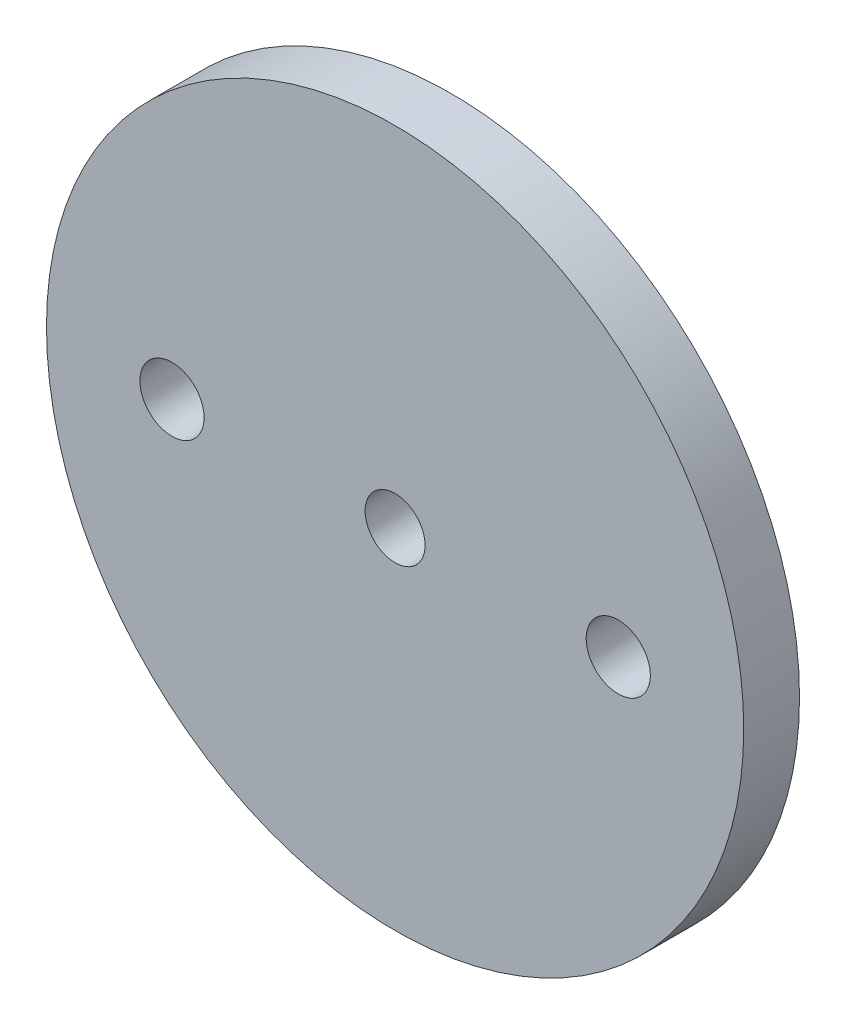
ISO-10303-21;
HEADER;
FILE_DESCRIPTION(('STEP AP214'),'2;1');
FILE_NAME('part.step','',(''),(''),'','','');
FILE_SCHEMA(('AUTOMOTIVE_DESIGN { 1 0 10303 214 1 1 1 1 }'));
ENDSEC;
DATA;
#1=APPLICATION_CONTEXT('core data for automotive mechanical design processes');
#2=APPLICATION_PROTOCOL_DEFINITION('international standard','automotive_design',2000,#1);
#3=PRODUCT_CONTEXT('',#1,'mechanical');
#4=PRODUCT('Part','Part','',(#3));
#5=PRODUCT_RELATED_PRODUCT_CATEGORY('part','',(#4));
#6=PRODUCT_DEFINITION_FORMATION('','',#4);
#7=PRODUCT_DEFINITION_CONTEXT('part definition',#1,'design');
#8=PRODUCT_DEFINITION('design','',#6,#7);
#9=PRODUCT_DEFINITION_SHAPE('','',#8);
#10=(LENGTH_UNIT() NAMED_UNIT(*) SI_UNIT(.MILLI.,.METRE.));
#11=(NAMED_UNIT(*) PLANE_ANGLE_UNIT() SI_UNIT($,.RADIAN.));
#12=(NAMED_UNIT(*) SI_UNIT($,.STERADIAN.) SOLID_ANGLE_UNIT());
#13=UNCERTAINTY_MEASURE_WITH_UNIT(LENGTH_MEASURE(1.E-05),#10,'distance_accuracy_value','');
#14=(GEOMETRIC_REPRESENTATION_CONTEXT(3) GLOBAL_UNCERTAINTY_ASSIGNED_CONTEXT((#13)) GLOBAL_UNIT_ASSIGNED_CONTEXT((#10,
#11,#12)) REPRESENTATION_CONTEXT('',''));
#15=CARTESIAN_POINT('',(0.,0.,0.));
#16=DIRECTION('',(0.,0.,1.));
#17=DIRECTION('',(1.,0.,0.));
#18=AXIS2_PLACEMENT_3D('',#15,#16,#17);
#19=CARTESIAN_POINT('',(0.,0.,2.));
#20=DIRECTION('',(0.,0.,1.));
#21=DIRECTION('',(1.,0.,0.));
#22=AXIS2_PLACEMENT_3D('',#19,#20,#21);
#23=PLANE('',#22);
#24=CARTESIAN_POINT('',(-8.,0.,2.));
#25=DIRECTION('',(0.,0.,1.));
#26=DIRECTION('',(1.,0.,0.));
#27=AXIS2_PLACEMENT_3D('',#24,#25,#26);
#28=CIRCLE('',#27,1.15);
#29=CARTESIAN_POINT('',(-6.85,0.,2.));
#30=VERTEX_POINT('',#29);
#31=EDGE_CURVE('E51',#30,#30,#28,.T.);
#32=ORIENTED_EDGE('',*,*,#31,.F.);
#33=EDGE_LOOP('',(#32));
#34=FACE_BOUND('',#33,.T.);
#35=CARTESIAN_POINT('',(0.,0.,2.));
#36=DIRECTION('',(0.,0.,1.));
#37=DIRECTION('',(1.,0.,0.));
#38=AXIS2_PLACEMENT_3D('',#35,#36,#37);
#39=CIRCLE('',#38,12.5);
#40=CARTESIAN_POINT('',(12.5,0.,2.));
#41=VERTEX_POINT('',#40);
#42=EDGE_CURVE('E10',#41,#41,#39,.T.);
#43=ORIENTED_EDGE('',*,*,#42,.T.);
#44=EDGE_LOOP('',(#43));
#45=FACE_BOUND('',#44,.T.);
#46=CARTESIAN_POINT('',(0.,0.,2.));
#47=DIRECTION('',(0.,0.,1.));
#48=DIRECTION('',(1.,0.,0.));
#49=AXIS2_PLACEMENT_3D('',#46,#47,#48);
#50=CIRCLE('',#49,1.075);
#51=CARTESIAN_POINT('',(1.075,0.,2.));
#52=VERTEX_POINT('',#51);
#53=EDGE_CURVE('E46',#52,#52,#50,.T.);
#54=ORIENTED_EDGE('',*,*,#53,.F.);
#55=EDGE_LOOP('',(#54));
#56=FACE_BOUND('',#55,.T.);
#57=CARTESIAN_POINT('',(8.00000000000025,0.,2.));
#58=DIRECTION('',(0.,0.,1.));
#59=DIRECTION('',(-1.,0.,0.));
#60=AXIS2_PLACEMENT_3D('',#57,#58,#59);
#61=CIRCLE('',#60,1.15);
#62=CARTESIAN_POINT('',(6.85000000000025,0.,2.));
#63=VERTEX_POINT('',#62);
#64=EDGE_CURVE('E57',#63,#63,#61,.T.);
#65=ORIENTED_EDGE('',*,*,#64,.F.);
#66=EDGE_LOOP('',(#65));
#67=FACE_BOUND('',#66,.T.);
#68=ADVANCED_FACE('F35',(#34,#45,#56,#67),#23,.T.);
#69=CARTESIAN_POINT('',(0.,0.,0.));
#70=DIRECTION('',(0.,0.,1.));
#71=DIRECTION('',(1.,0.,0.));
#72=AXIS2_PLACEMENT_3D('',#69,#70,#71);
#73=PLANE('',#72);
#74=CARTESIAN_POINT('',(0.,0.,0.));
#75=DIRECTION('',(0.,0.,1.));
#76=DIRECTION('',(1.,0.,0.));
#77=AXIS2_PLACEMENT_3D('',#74,#75,#76);
#78=CIRCLE('',#77,12.5);
#79=CARTESIAN_POINT('',(12.5,0.,0.));
#80=VERTEX_POINT('',#79);
#81=EDGE_CURVE('E39',#80,#80,#78,.T.);
#82=ORIENTED_EDGE('',*,*,#81,.F.);
#83=EDGE_LOOP('',(#82));
#84=FACE_BOUND('',#83,.T.);
#85=CARTESIAN_POINT('',(0.,0.,0.));
#86=DIRECTION('',(0.,0.,1.));
#87=DIRECTION('',(1.,0.,0.));
#88=AXIS2_PLACEMENT_3D('',#85,#86,#87);
#89=CIRCLE('',#88,1.075);
#90=CARTESIAN_POINT('',(1.075,0.,0.));
#91=VERTEX_POINT('',#90);
#92=EDGE_CURVE('E48',#91,#91,#89,.T.);
#93=ORIENTED_EDGE('',*,*,#92,.T.);
#94=EDGE_LOOP('',(#93));
#95=FACE_BOUND('',#94,.T.);
#96=CARTESIAN_POINT('',(-8.,0.,0.));
#97=DIRECTION('',(0.,0.,1.));
#98=DIRECTION('',(1.,0.,0.));
#99=AXIS2_PLACEMENT_3D('',#96,#97,#98);
#100=CIRCLE('',#99,1.15);
#101=CARTESIAN_POINT('',(-6.85,0.,0.));
#102=VERTEX_POINT('',#101);
#103=EDGE_CURVE('E54',#102,#102,#100,.T.);
#104=ORIENTED_EDGE('',*,*,#103,.T.);
#105=EDGE_LOOP('',(#104));
#106=FACE_BOUND('',#105,.T.);
#107=CARTESIAN_POINT('',(8.00000000000025,0.,0.));
#108=DIRECTION('',(0.,0.,1.));
#109=DIRECTION('',(-1.,0.,0.));
#110=AXIS2_PLACEMENT_3D('',#107,#108,#109);
#111=CIRCLE('',#110,1.15);
#112=CARTESIAN_POINT('',(6.85000000000025,0.,0.));
#113=VERTEX_POINT('',#112);
#114=EDGE_CURVE('E60',#113,#113,#111,.T.);
#115=ORIENTED_EDGE('',*,*,#114,.T.);
#116=EDGE_LOOP('',(#115));
#117=FACE_BOUND('',#116,.T.);
#118=ADVANCED_FACE('F70',(#84,#95,#106,#117),#73,.F.);
#119=CARTESIAN_POINT('',(0.,0.,2.));
#120=DIRECTION('',(0.,0.,-1.));
#121=DIRECTION('',(-1.,0.,0.));
#122=AXIS2_PLACEMENT_3D('',#119,#120,#121);
#123=CYLINDRICAL_SURFACE('',#122,12.5);
#124=ORIENTED_EDGE('',*,*,#42,.F.);
#125=EDGE_LOOP('',(#124));
#126=FACE_BOUND('',#125,.T.);
#127=ORIENTED_EDGE('',*,*,#81,.T.);
#128=EDGE_LOOP('',(#127));
#129=FACE_BOUND('',#128,.T.);
#130=ADVANCED_FACE('F37',(#126,#129),#123,.T.);
#131=CARTESIAN_POINT('',(0.,0.,2.));
#132=DIRECTION('',(0.,0.,-1.));
#133=DIRECTION('',(-1.,0.,0.));
#134=AXIS2_PLACEMENT_3D('',#131,#132,#133);
#135=CYLINDRICAL_SURFACE('',#134,1.075);
#136=ORIENTED_EDGE('',*,*,#53,.T.);
#137=EDGE_LOOP('',(#136));
#138=FACE_BOUND('',#137,.T.);
#139=ORIENTED_EDGE('',*,*,#92,.F.);
#140=EDGE_LOOP('',(#139));
#141=FACE_BOUND('',#140,.T.);
#142=ADVANCED_FACE('F79',(#138,#141),#135,.F.);
#143=CARTESIAN_POINT('',(-8.,0.,2.));
#144=DIRECTION('',(0.,0.,-1.));
#145=DIRECTION('',(-1.,0.,0.));
#146=AXIS2_PLACEMENT_3D('',#143,#144,#145);
#147=CYLINDRICAL_SURFACE('',#146,1.15);
#148=ORIENTED_EDGE('',*,*,#31,.T.);
#149=EDGE_LOOP('',(#148));
#150=FACE_BOUND('',#149,.T.);
#151=ORIENTED_EDGE('',*,*,#103,.F.);
#152=EDGE_LOOP('',(#151));
#153=FACE_BOUND('',#152,.T.);
#154=ADVANCED_FACE('F82',(#150,#153),#147,.F.);
#155=CARTESIAN_POINT('',(8.00000000000025,0.,2.));
#156=DIRECTION('',(0.,0.,-1.));
#157=DIRECTION('',(-1.,0.,0.));
#158=AXIS2_PLACEMENT_3D('',#155,#156,#157);
#159=CYLINDRICAL_SURFACE('',#158,1.15);
#160=ORIENTED_EDGE('',*,*,#64,.T.);
#161=EDGE_LOOP('',(#160));
#162=FACE_BOUND('',#161,.T.);
#163=ORIENTED_EDGE('',*,*,#114,.F.);
#164=EDGE_LOOP('',(#163));
#165=FACE_BOUND('',#164,.T.);
#166=ADVANCED_FACE('F66',(#162,#165),#159,.F.);
#167=CLOSED_SHELL('',(#68,#118,#130,#142,#154,#166));
#168=MANIFOLD_SOLID_BREP('B2',#167);
#169=ADVANCED_BREP_SHAPE_REPRESENTATION('',(#18,#168),#14);
#170=SHAPE_DEFINITION_REPRESENTATION(#9,#169);
ENDSEC;
END-ISO-10303-21;
